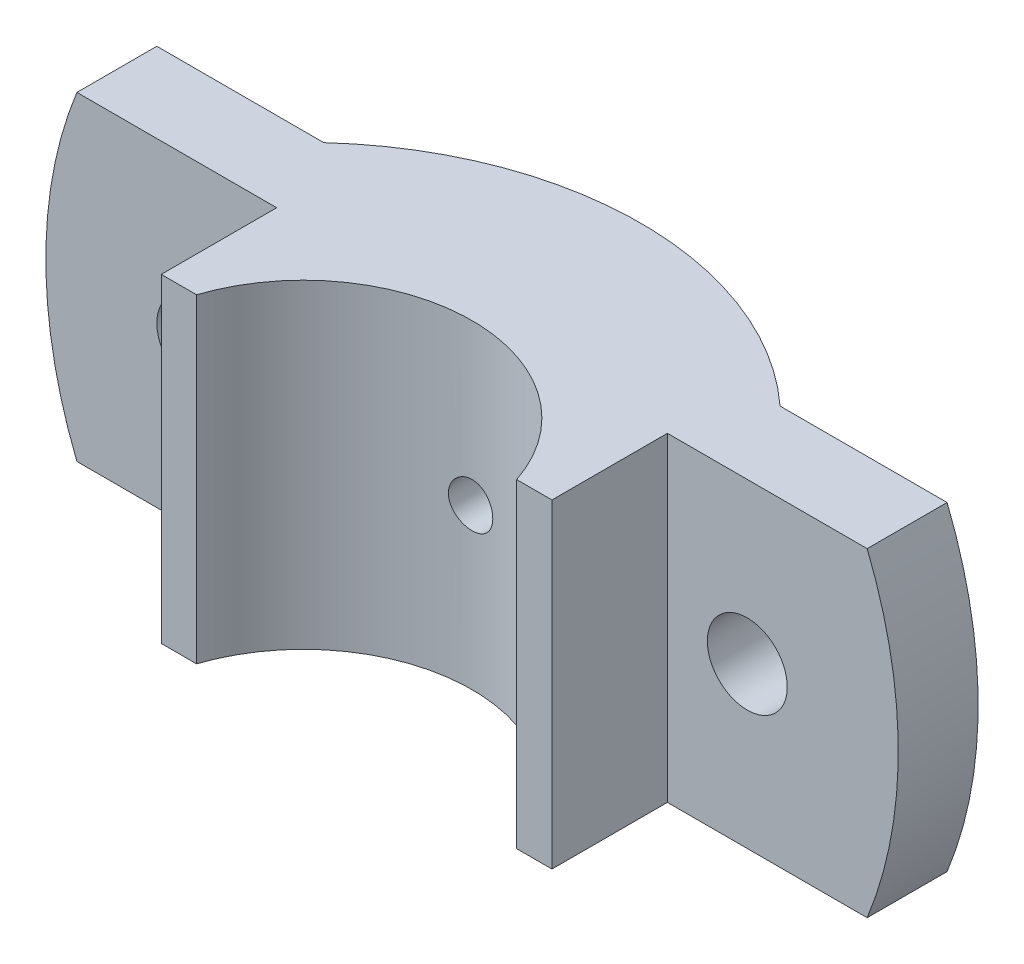
ISO-10303-21;
HEADER;
FILE_DESCRIPTION(('STEP AP214'),'2;1');
FILE_NAME('part.step','',(''),(''),'','','');
FILE_SCHEMA(('AUTOMOTIVE_DESIGN { 1 0 10303 214 1 1 1 1 }'));
ENDSEC;
DATA;
#1=APPLICATION_CONTEXT('core data for automotive mechanical design processes');
#2=APPLICATION_PROTOCOL_DEFINITION('international standard','automotive_design',2000,#1);
#3=PRODUCT_CONTEXT('',#1,'mechanical');
#4=PRODUCT('Part','Part','',(#3));
#5=PRODUCT_RELATED_PRODUCT_CATEGORY('part','',(#4));
#6=PRODUCT_DEFINITION_FORMATION('','',#4);
#7=PRODUCT_DEFINITION_CONTEXT('part definition',#1,'design');
#8=PRODUCT_DEFINITION('design','',#6,#7);
#9=PRODUCT_DEFINITION_SHAPE('','',#8);
#10=(LENGTH_UNIT() NAMED_UNIT(*) SI_UNIT(.MILLI.,.METRE.));
#11=(NAMED_UNIT(*) PLANE_ANGLE_UNIT() SI_UNIT($,.RADIAN.));
#12=(NAMED_UNIT(*) SI_UNIT($,.STERADIAN.) SOLID_ANGLE_UNIT());
#13=UNCERTAINTY_MEASURE_WITH_UNIT(LENGTH_MEASURE(1.E-05),#10,'distance_accuracy_value','');
#14=(GEOMETRIC_REPRESENTATION_CONTEXT(3) GLOBAL_UNCERTAINTY_ASSIGNED_CONTEXT((#13)) GLOBAL_UNIT_ASSIGNED_CONTEXT((#10,
#11,#12)) REPRESENTATION_CONTEXT('',''));
#15=CARTESIAN_POINT('',(0.,0.,0.));
#16=DIRECTION('',(0.,0.,1.));
#17=DIRECTION('',(1.,0.,0.));
#18=AXIS2_PLACEMENT_3D('',#15,#16,#17);
#19=CARTESIAN_POINT('',(22.,18.,-19.));
#20=DIRECTION('',(0.,0.,-1.));
#21=DIRECTION('',(-1.,0.,0.));
#22=AXIS2_PLACEMENT_3D('',#19,#20,#21);
#23=PLANE('',#22);
#24=CARTESIAN_POINT('',(31.,0.,-19.));
#25=DIRECTION('',(0.,0.,-1.));
#26=DIRECTION('',(-1.,0.,0.));
#27=AXIS2_PLACEMENT_3D('',#24,#25,#26);
#28=CIRCLE('',#27,4.49999999999999);
#29=CARTESIAN_POINT('',(26.5,0.,-19.));
#30=VERTEX_POINT('',#29);
#31=EDGE_CURVE('E353',#30,#30,#28,.F.);
#32=ORIENTED_EDGE('',*,*,#31,.F.);
#33=EDGE_LOOP('',(#32));
#34=FACE_BOUND('',#33,.T.);
#35=CARTESIAN_POINT('',(0.,0.,-19.));
#36=DIRECTION('',(0.,0.,-1.));
#37=DIRECTION('',(-1.,0.,0.));
#38=AXIS2_PLACEMENT_3D('',#35,#36,#37);
#39=CIRCLE('',#38,48.);
#40=CARTESIAN_POINT('',(44.497190922574,18.,-19.));
#41=VERTEX_POINT('',#40);
#42=CARTESIAN_POINT('',(44.497190922574,-18.,-19.));
#43=VERTEX_POINT('',#42);
#44=EDGE_CURVE('E50',#41,#43,#39,.T.);
#45=ORIENTED_EDGE('',*,*,#44,.F.);
#46=DIRECTION('',(1.,0.,0.));
#47=VECTOR('',#46,1.);
#48=CARTESIAN_POINT('',(22.,18.,-19.));
#49=LINE('',#48,#47);
#50=CARTESIAN_POINT('',(22.,18.,-19.));
#51=VERTEX_POINT('',#50);
#52=EDGE_CURVE('E147',#51,#41,#49,.T.);
#53=ORIENTED_EDGE('',*,*,#52,.F.);
#54=DIRECTION('',(0.,-1.,0.));
#55=VECTOR('',#54,1.);
#56=CARTESIAN_POINT('',(22.,18.,-19.));
#57=LINE('',#56,#55);
#58=CARTESIAN_POINT('',(22.,-18.,-19.));
#59=VERTEX_POINT('',#58);
#60=EDGE_CURVE('E210',#51,#59,#57,.T.);
#61=ORIENTED_EDGE('',*,*,#60,.T.);
#62=DIRECTION('',(1.,0.,0.));
#63=VECTOR('',#62,1.);
#64=CARTESIAN_POINT('',(22.,-18.,-19.));
#65=LINE('',#64,#63);
#66=EDGE_CURVE('E178',#59,#43,#65,.T.);
#67=ORIENTED_EDGE('',*,*,#66,.T.);
#68=EDGE_LOOP('',(#45,#53,#61,#67));
#69=FACE_BOUND('',#68,.T.);
#70=ADVANCED_FACE('F35',(#34,#69),#23,.F.);
#71=CARTESIAN_POINT('',(50.,18.,-28.));
#72=DIRECTION('',(0.,0.,1.));
#73=DIRECTION('',(1.,0.,0.));
#74=AXIS2_PLACEMENT_3D('',#71,#72,#73);
#75=PLANE('',#74);
#76=CARTESIAN_POINT('',(31.,0.,-28.));
#77=DIRECTION('',(0.,0.,1.));
#78=DIRECTION('',(1.,0.,0.));
#79=AXIS2_PLACEMENT_3D('',#76,#77,#78);
#80=CIRCLE('',#79,4.49999999999999);
#81=CARTESIAN_POINT('',(35.5,0.,-28.));
#82=VERTEX_POINT('',#81);
#83=EDGE_CURVE('E297',#82,#82,#80,.T.);
#84=ORIENTED_EDGE('',*,*,#83,.T.);
#85=EDGE_LOOP('',(#84));
#86=FACE_BOUND('',#85,.T.);
#87=CARTESIAN_POINT('',(0.,0.,-28.));
#88=DIRECTION('',(0.,0.,1.));
#89=DIRECTION('',(1.,0.,0.));
#90=AXIS2_PLACEMENT_3D('',#87,#88,#89);
#91=CIRCLE('',#90,48.);
#92=CARTESIAN_POINT('',(44.497190922574,-18.,-28.));
#93=VERTEX_POINT('',#92);
#94=CARTESIAN_POINT('',(44.497190922574,18.,-28.));
#95=VERTEX_POINT('',#94);
#96=EDGE_CURVE('E135',#93,#95,#91,.T.);
#97=ORIENTED_EDGE('',*,*,#96,.F.);
#98=DIRECTION('',(-1.,0.,0.));
#99=VECTOR('',#98,1.);
#100=CARTESIAN_POINT('',(50.,-18.,-28.));
#101=LINE('',#100,#99);
#102=CARTESIAN_POINT('',(25.6904651573303,-18.,-28.));
#103=VERTEX_POINT('',#102);
#104=EDGE_CURVE('E181',#93,#103,#101,.T.);
#105=ORIENTED_EDGE('',*,*,#104,.T.);
#106=DIRECTION('',(0.,-1.,0.));
#107=VECTOR('',#106,1.);
#108=CARTESIAN_POINT('',(25.6904651573303,18.,-28.));
#109=LINE('',#108,#107);
#110=CARTESIAN_POINT('',(25.6904651573303,-6.63768331230679,-28.));
#111=VERTEX_POINT('',#110);
#112=EDGE_CURVE('E208',#111,#103,#109,.T.);
#113=ORIENTED_EDGE('',*,*,#112,.F.);
#114=CARTESIAN_POINT('',(31.,0.,-28.));
#115=DIRECTION('',(0.,0.,1.));
#116=DIRECTION('',(1.,0.,0.));
#117=AXIS2_PLACEMENT_3D('',#114,#115,#116);
#118=CIRCLE('',#117,8.5);
#119=CARTESIAN_POINT('',(25.6904651573303,6.63768331230679,-28.));
#120=VERTEX_POINT('',#119);
#121=EDGE_CURVE('E58',#120,#111,#118,.T.);
#122=ORIENTED_EDGE('',*,*,#121,.F.);
#123=CARTESIAN_POINT('',(25.6904651573303,18.,-28.));
#124=VERTEX_POINT('',#123);
#125=EDGE_CURVE('E151',#124,#120,#109,.T.);
#126=ORIENTED_EDGE('',*,*,#125,.F.);
#127=DIRECTION('',(-1.,0.,0.));
#128=VECTOR('',#127,1.);
#129=CARTESIAN_POINT('',(50.,18.,-28.));
#130=LINE('',#129,#128);
#131=EDGE_CURVE('E145',#95,#124,#130,.T.);
#132=ORIENTED_EDGE('',*,*,#131,.F.);
#133=EDGE_LOOP('',(#97,#105,#113,#122,#126,#132));
#134=FACE_BOUND('',#133,.T.);
#135=ADVANCED_FACE('F149',(#86,#134),#75,.F.);
#136=CARTESIAN_POINT('',(0.,18.,0.));
#137=DIRECTION('',(0.,1.,0.));
#138=DIRECTION('',(0.,0.,1.));
#139=AXIS2_PLACEMENT_3D('',#136,#137,#138);
#140=PLANE('',#139);
#141=ORIENTED_EDGE('',*,*,#52,.T.);
#142=DIRECTION('',(0.,0.,1.));
#143=VECTOR('',#142,1.);
#144=CARTESIAN_POINT('',(44.497190922574,18.,-38.));
#145=LINE('',#144,#143);
#146=EDGE_CURVE('E138',#95,#41,#145,.T.);
#147=ORIENTED_EDGE('',*,*,#146,.F.);
#148=ORIENTED_EDGE('',*,*,#131,.T.);
#149=CARTESIAN_POINT('',(0.,18.,0.));
#150=DIRECTION('',(0.,1.,0.));
#151=DIRECTION('',(0.,0.,1.));
#152=AXIS2_PLACEMENT_3D('',#149,#150,#151);
#153=CIRCLE('',#152,38.);
#154=CARTESIAN_POINT('',(-25.6904651573303,18.,-28.));
#155=VERTEX_POINT('',#154);
#156=EDGE_CURVE('E153',#124,#155,#153,.T.);
#157=ORIENTED_EDGE('',*,*,#156,.T.);
#158=DIRECTION('',(-1.,0.,0.));
#159=VECTOR('',#158,1.);
#160=CARTESIAN_POINT('',(-50.,18.,-28.));
#161=LINE('',#160,#159);
#162=CARTESIAN_POINT('',(-44.497190922574,18.,-28.));
#163=VERTEX_POINT('',#162);
#164=EDGE_CURVE('E155',#155,#163,#161,.T.);
#165=ORIENTED_EDGE('',*,*,#164,.T.);
#166=DIRECTION('',(0.,0.,1.));
#167=VECTOR('',#166,1.);
#168=CARTESIAN_POINT('',(-44.497190922574,18.,-38.));
#169=LINE('',#168,#167);
#170=CARTESIAN_POINT('',(-44.497190922574,18.,-19.));
#171=VERTEX_POINT('',#170);
#172=EDGE_CURVE('E338',#163,#171,#169,.T.);
#173=ORIENTED_EDGE('',*,*,#172,.T.);
#174=DIRECTION('',(1.,0.,0.));
#175=VECTOR('',#174,1.);
#176=CARTESIAN_POINT('',(-22.,18.,-19.));
#177=LINE('',#176,#175);
#178=CARTESIAN_POINT('',(-22.,18.,-19.));
#179=VERTEX_POINT('',#178);
#180=EDGE_CURVE('E163',#171,#179,#177,.T.);
#181=ORIENTED_EDGE('',*,*,#180,.T.);
#182=DIRECTION('',(0.,0.,1.));
#183=VECTOR('',#182,1.);
#184=CARTESIAN_POINT('',(-22.,18.,-6.));
#185=LINE('',#184,#183);
#186=CARTESIAN_POINT('',(-22.,18.,-6.));
#187=VERTEX_POINT('',#186);
#188=EDGE_CURVE('E165',#179,#187,#185,.T.);
#189=ORIENTED_EDGE('',*,*,#188,.T.);
#190=DIRECTION('',(1.,0.,0.));
#191=VECTOR('',#190,1.);
#192=CARTESIAN_POINT('',(-18.0277563773199,18.,-6.));
#193=LINE('',#192,#191);
#194=CARTESIAN_POINT('',(-18.0277563773199,18.,-6.));
#195=VERTEX_POINT('',#194);
#196=EDGE_CURVE('E167',#187,#195,#193,.T.);
#197=ORIENTED_EDGE('',*,*,#196,.T.);
#198=CARTESIAN_POINT('',(0.,18.,0.));
#199=DIRECTION('',(0.,-1.,0.));
#200=DIRECTION('',(0.,0.,1.));
#201=AXIS2_PLACEMENT_3D('',#198,#199,#200);
#202=CIRCLE('',#201,19.);
#203=CARTESIAN_POINT('',(18.0277563773199,18.,-6.));
#204=VERTEX_POINT('',#203);
#205=EDGE_CURVE('E195',#195,#204,#202,.T.);
#206=ORIENTED_EDGE('',*,*,#205,.T.);
#207=DIRECTION('',(1.,0.,0.));
#208=VECTOR('',#207,1.);
#209=CARTESIAN_POINT('',(18.0277563773199,18.,-6.));
#210=LINE('',#209,#208);
#211=CARTESIAN_POINT('',(22.,18.,-6.));
#212=VERTEX_POINT('',#211);
#213=EDGE_CURVE('E279',#204,#212,#210,.T.);
#214=ORIENTED_EDGE('',*,*,#213,.T.);
#215=DIRECTION('',(0.,0.,-1.));
#216=VECTOR('',#215,1.);
#217=CARTESIAN_POINT('',(22.,18.,-6.));
#218=LINE('',#217,#216);
#219=EDGE_CURVE('E157',#212,#51,#218,.T.);
#220=ORIENTED_EDGE('',*,*,#219,.T.);
#221=EDGE_LOOP('',(#141,#147,#148,#157,#165,#173,#181,#189,#197,#206,#214,#220));
#222=FACE_BOUND('',#221,.T.);
#223=ADVANCED_FACE('F144',(#222),#140,.T.);
#224=CARTESIAN_POINT('',(0.,-18.,0.));
#225=DIRECTION('',(0.,1.,0.));
#226=DIRECTION('',(0.,0.,1.));
#227=AXIS2_PLACEMENT_3D('',#224,#225,#226);
#228=PLANE('',#227);
#229=DIRECTION('',(0.,0.,1.));
#230=VECTOR('',#229,1.);
#231=CARTESIAN_POINT('',(44.497190922574,-18.,-38.));
#232=LINE('',#231,#230);
#233=EDGE_CURVE('E11',#43,#93,#232,.F.);
#234=ORIENTED_EDGE('',*,*,#233,.F.);
#235=ORIENTED_EDGE('',*,*,#66,.F.);
#236=DIRECTION('',(0.,0.,-1.));
#237=VECTOR('',#236,1.);
#238=CARTESIAN_POINT('',(22.,-18.,-6.));
#239=LINE('',#238,#237);
#240=CARTESIAN_POINT('',(22.,-18.,-6.));
#241=VERTEX_POINT('',#240);
#242=EDGE_CURVE('E176',#241,#59,#239,.T.);
#243=ORIENTED_EDGE('',*,*,#242,.F.);
#244=DIRECTION('',(1.,0.,0.));
#245=VECTOR('',#244,1.);
#246=CARTESIAN_POINT('',(18.0277563773199,-18.,-6.));
#247=LINE('',#246,#245);
#248=CARTESIAN_POINT('',(18.0277563773199,-18.,-6.));
#249=VERTEX_POINT('',#248);
#250=EDGE_CURVE('E173',#249,#241,#247,.T.);
#251=ORIENTED_EDGE('',*,*,#250,.F.);
#252=CARTESIAN_POINT('',(0.,-18.,0.));
#253=DIRECTION('',(0.,-1.,0.));
#254=DIRECTION('',(0.,0.,1.));
#255=AXIS2_PLACEMENT_3D('',#252,#253,#254);
#256=CIRCLE('',#255,19.);
#257=CARTESIAN_POINT('',(-18.0277563773199,-18.,-6.));
#258=VERTEX_POINT('',#257);
#259=EDGE_CURVE('E170',#258,#249,#256,.T.);
#260=ORIENTED_EDGE('',*,*,#259,.F.);
#261=DIRECTION('',(1.,0.,0.));
#262=VECTOR('',#261,1.);
#263=CARTESIAN_POINT('',(-18.0277563773199,-18.,-6.));
#264=LINE('',#263,#262);
#265=CARTESIAN_POINT('',(-22.,-18.,-6.));
#266=VERTEX_POINT('',#265);
#267=EDGE_CURVE('E193',#266,#258,#264,.T.);
#268=ORIENTED_EDGE('',*,*,#267,.F.);
#269=DIRECTION('',(0.,0.,1.));
#270=VECTOR('',#269,1.);
#271=CARTESIAN_POINT('',(-22.,-18.,-6.));
#272=LINE('',#271,#270);
#273=CARTESIAN_POINT('',(-22.,-18.,-19.));
#274=VERTEX_POINT('',#273);
#275=EDGE_CURVE('E191',#274,#266,#272,.T.);
#276=ORIENTED_EDGE('',*,*,#275,.F.);
#277=DIRECTION('',(1.,0.,0.));
#278=VECTOR('',#277,1.);
#279=CARTESIAN_POINT('',(-22.,-18.,-19.));
#280=LINE('',#279,#278);
#281=CARTESIAN_POINT('',(-44.497190922574,-18.,-19.));
#282=VERTEX_POINT('',#281);
#283=EDGE_CURVE('E189',#282,#274,#280,.T.);
#284=ORIENTED_EDGE('',*,*,#283,.F.);
#285=DIRECTION('',(0.,0.,1.));
#286=VECTOR('',#285,1.);
#287=CARTESIAN_POINT('',(-44.497190922574,-18.,-38.));
#288=LINE('',#287,#286);
#289=CARTESIAN_POINT('',(-44.497190922574,-18.,-28.));
#290=VERTEX_POINT('',#289);
#291=EDGE_CURVE('E219',#282,#290,#288,.F.);
#292=ORIENTED_EDGE('',*,*,#291,.T.);
#293=DIRECTION('',(-1.,0.,0.));
#294=VECTOR('',#293,1.);
#295=CARTESIAN_POINT('',(-50.,-18.,-28.));
#296=LINE('',#295,#294);
#297=CARTESIAN_POINT('',(-25.6904651573303,-18.,-28.));
#298=VERTEX_POINT('',#297);
#299=EDGE_CURVE('E186',#298,#290,#296,.T.);
#300=ORIENTED_EDGE('',*,*,#299,.F.);
#301=CARTESIAN_POINT('',(0.,-18.,0.));
#302=DIRECTION('',(0.,1.,0.));
#303=DIRECTION('',(0.,0.,1.));
#304=AXIS2_PLACEMENT_3D('',#301,#302,#303);
#305=CIRCLE('',#304,38.);
#306=EDGE_CURVE('E183',#103,#298,#305,.T.);
#307=ORIENTED_EDGE('',*,*,#306,.F.);
#308=ORIENTED_EDGE('',*,*,#104,.F.);
#309=EDGE_LOOP('',(#234,#235,#243,#251,#260,#268,#276,#284,#292,#300,#307,#308));
#310=FACE_BOUND('',#309,.T.);
#311=ADVANCED_FACE('F328',(#310),#228,.F.);
#312=CARTESIAN_POINT('',(0.,18.,0.));
#313=DIRECTION('',(0.,-1.,0.));
#314=DIRECTION('',(0.,0.,-1.));
#315=AXIS2_PLACEMENT_3D('',#312,#313,#314);
#316=CYLINDRICAL_SURFACE('',#315,38.);
#317=CARTESIAN_POINT('',(-3.,0.,-37.8813938497516));
#318=CARTESIAN_POINT('',(-2.99999263785232,-0.168229356223722,-37.881395424836));
#319=CARTESIAN_POINT('',(-2.98580184849922,-0.336574006245494,-37.8825265582867));
#320=CARTESIAN_POINT('',(-2.92939974932902,-0.668607649957893,-37.8869289647691));
#321=CARTESIAN_POINT('',(-2.88715648723707,-0.832291112499562,-37.8902026781767));
#322=CARTESIAN_POINT('',(-2.77587681608236,-1.15014522375751,-37.8985171541647));
#323=CARTESIAN_POINT('',(-2.70685535144458,-1.30432112294825,-37.9035569309858));
#324=CARTESIAN_POINT('',(-2.54400458445208,-1.59886160168987,-37.9148344391245));
#325=CARTESIAN_POINT('',(-2.45018067379415,-1.73922917388467,-37.92107191));
#326=CARTESIAN_POINT('',(-2.24015280345188,-2.00253137226757,-37.9340582512773));
#327=CARTESIAN_POINT('',(-2.12390328154721,-2.12542960763649,-37.9408081455451));
#328=CARTESIAN_POINT('',(-1.87242010716811,-2.34999209013841,-37.9540493837728));
#329=CARTESIAN_POINT('',(-1.7371856346283,-2.45165541954578,-37.9605407165486));
#330=CARTESIAN_POINT('',(-1.45135636719248,-2.63098168610704,-37.9725429812434));
#331=CARTESIAN_POINT('',(-1.3007419119018,-2.708613379424,-37.9780526329515));
#332=CARTESIAN_POINT('',(-0.988565369760012,-2.83747282349098,-37.9874597537665));
#333=CARTESIAN_POINT('',(-0.827003457103221,-2.88870099425837,-37.9913572485189));
#334=CARTESIAN_POINT('',(-0.497878390626905,-2.96319512715382,-37.9970937704964));
#335=CARTESIAN_POINT('',(-0.330328567016738,-2.98651964678538,-37.998937107936));
#336=CARTESIAN_POINT('',(0.00631733654750819,-3.00472535926791,-38.0003722094706));
#337=CARTESIAN_POINT('',(0.17541339034767,-2.99960703233397,-37.9999640115795));
#338=CARTESIAN_POINT('',(0.509954787192965,-2.96112032248106,-37.9969456003133));
#339=CARTESIAN_POINT('',(0.675407425277911,-2.92781491240174,-37.9943402955467));
#340=CARTESIAN_POINT('',(0.998366668593193,-2.83399732705022,-37.9872264182713));
#341=CARTESIAN_POINT('',(1.1558732048081,-2.77348491551835,-37.9827178292348));
#342=CARTESIAN_POINT('',(1.45867002090717,-2.62690060373558,-37.9722962502068));
#343=CARTESIAN_POINT('',(1.6039465541759,-2.54080042217035,-37.9663817077167));
#344=CARTESIAN_POINT('',(1.87800944429183,-2.34550517866702,-37.9538131184224));
#345=CARTESIAN_POINT('',(2.00679550141833,-2.23630969705862,-37.9471590581814));
#346=CARTESIAN_POINT('',(2.24458971981857,-1.99756841972296,-37.9338380622355));
#347=CARTESIAN_POINT('',(2.35354296660022,-1.86796791907116,-37.9271711409281));
#348=CARTESIAN_POINT('',(2.54815472752468,-1.59228636571936,-37.9145941321889));
#349=CARTESIAN_POINT('',(2.63381322519709,-1.44620530136698,-37.9086840452923));
#350=CARTESIAN_POINT('',(2.77940144234371,-1.14167162060739,-37.8982886351211));
#351=CARTESIAN_POINT('',(2.83932843779762,-0.983217696466581,-37.8938034627057));
#352=CARTESIAN_POINT('',(2.93171253141031,-0.658454052626348,-37.8867684945926));
#353=CARTESIAN_POINT('',(2.96417014717686,-0.492144481013883,-37.8842186624274));
#354=CARTESIAN_POINT('',(3.00062486955395,-0.156870629588011,-37.8813488492975));
#355=CARTESIAN_POINT('',(3.00469849779479,0.0120852808075237,-37.8810228729924));
#356=CARTESIAN_POINT('',(2.98446993701008,0.348277674479456,-37.8826218486592));
#357=CARTESIAN_POINT('',(2.96016798514648,0.515514172114851,-37.884546781818));
#358=CARTESIAN_POINT('',(2.88394184726828,0.843301603254928,-37.8904252096708));
#359=CARTESIAN_POINT('',(2.83205326228916,1.00386086655318,-37.8943760896121));
#360=CARTESIAN_POINT('',(2.70216294400362,1.31399395677734,-37.9038590548662));
#361=CARTESIAN_POINT('',(2.62416083401247,1.46356762519929,-37.9093911629878));
#362=CARTESIAN_POINT('',(2.44406357833825,1.74783416137562,-37.9214277776749));
#363=CARTESIAN_POINT('',(2.34191737427747,1.88249459296493,-37.9279343341079));
#364=CARTESIAN_POINT('',(2.11650535947004,2.13278456634997,-37.9411797159946));
#365=CARTESIAN_POINT('',(1.99323922217928,2.2484138138424,-37.9479185450382));
#366=CARTESIAN_POINT('',(1.72875604909499,2.45761968980163,-37.9608869464052));
#367=CARTESIAN_POINT('',(1.58749965829182,2.55114664697588,-37.9671153515116));
#368=CARTESIAN_POINT('',(1.29124223392212,2.71315246287969,-37.9783443227055));
#369=CARTESIAN_POINT('',(1.13624132557013,2.78163154976985,-37.9833448999771));
#370=CARTESIAN_POINT('',(0.817073838218854,2.8915121915042,-37.9915493740706));
#371=CARTESIAN_POINT('',(0.652917946506943,2.93294463032733,-37.9947553195452));
#372=CARTESIAN_POINT('',(0.31995323250893,2.98765683143964,-37.999017594232));
#373=CARTESIAN_POINT('',(0.151144488421416,3.00093706657949,-38.0000739595491));
#374=CARTESIAN_POINT('',(-0.185844007724724,2.99896261174756,-37.9999181203354));
#375=CARTESIAN_POINT('',(-0.35402422206125,2.98378540562109,-37.9987120758837));
#376=CARTESIAN_POINT('',(-0.685439460070172,2.92548825985853,-37.9941791393791));
#377=CARTESIAN_POINT('',(-0.848674476485684,2.88236827921959,-37.9908522442141));
#378=CARTESIAN_POINT('',(-1.16557212517757,2.76942883565186,-37.9824510315142));
#379=CARTESIAN_POINT('',(-1.3192351758783,2.69961054075429,-37.9773767904253));
#380=CARTESIAN_POINT('',(-1.61267080850138,2.53526551305573,-37.9660490429656));
#381=CARTESIAN_POINT('',(-1.7524436427022,2.44073922912224,-37.9597955580186));
#382=CARTESIAN_POINT('',(-2.01452730784427,2.22937105364119,-37.9467913112364));
#383=CARTESIAN_POINT('',(-2.13679197870458,2.1124720037035,-37.9400393035084));
#384=CARTESIAN_POINT('',(-2.3600119308789,1.85977604977668,-37.926809547746));
#385=CARTESIAN_POINT('',(-2.46096203215627,1.72397456524185,-37.9203318666858));
#386=CARTESIAN_POINT('',(-2.63880908526894,1.43709086811672,-37.9083720300883));
#387=CARTESIAN_POINT('',(-2.71566430398237,1.28598273615028,-37.9028916086487));
#388=CARTESIAN_POINT('',(-2.84281465262269,0.973068347368231,-37.8935681492736));
#389=CARTESIAN_POINT('',(-2.89314045280837,0.811274688620424,-37.8897232215665));
#390=CARTESIAN_POINT('',(-2.95292421077471,0.540431663186952,-37.8850993601198));
#391=CARTESIAN_POINT('',(-2.97055431578336,0.433126408915519,-37.883716139462));
#392=CARTESIAN_POINT('',(-2.99409457369405,0.217230128113448,-37.8818628767795));
#393=CARTESIAN_POINT('',(-3.00000475432558,0.108639104625571,-37.8813928325941));
#394=CARTESIAN_POINT('',(-3.,0.,-37.8813938497516));
#395=B_SPLINE_CURVE_WITH_KNOTS('',3,(#317,#318,#319,#320,#321,#322,#323,#324,#325,#326,#327,
#328,#329,#330,#331,#332,#333,#334,#335,#336,#337,#338,#339,#340,#341,#342,#343,#344,#345,#346,
#347,#348,#349,#350,#351,#352,#353,#354,#355,#356,#357,#358,#359,#360,#361,#362,#363,#364,#365,
#366,#367,#368,#369,#370,#371,#372,#373,#374,#375,#376,#377,#378,#379,#380,#381,#382,#383,#384,
#385,#386,#387,#388,#389,#390,#391,#392,#393,#394),.UNSPECIFIED.,.T.,.F.,(4,2,2,2,2,2,2,2,2,2,2,
2,2,2,2,2,2,2,2,2,2,2,2,2,2,2,2,2,2,2,2,2,2,2,2,2,2,2,4),(0.,0.50429142166999,1.00915822788302,
1.51374368152857,2.01821953559138,2.52373134073238,3.02926498845646,3.53545315301367,
4.04163326507022,4.54674925358301,5.05185671399058,5.55583868228783,6.05982502713928,
6.56437049631087,7.0689251344883,7.57485624621251,8.08078771565083,8.58677273143867,
9.0927482126973,9.59735908295555,10.1019657357268,10.6059227598395,11.10988705379,
11.6149267875576,12.1199743306602,12.6261463157289,13.1323136899712,13.6379020669613,
14.1434819519093,14.6476872439429,15.1518932758423,15.6560772516295,16.1602520685946,
16.6657325841807,17.1713358046313,17.6778099691558,18.1836973153048,18.5093592531184,
18.8350204204103),.UNSPECIFIED.);
#396=CARTESIAN_POINT('',(-3.,0.,-37.8813938497516));
#397=VERTEX_POINT('',#396);
#398=EDGE_CURVE('E44',#397,#397,#395,.T.);
#399=ORIENTED_EDGE('',*,*,#398,.T.);
#400=EDGE_LOOP('',(#399));
#401=FACE_BOUND('',#400,.T.);
#402=ORIENTED_EDGE('',*,*,#125,.T.);
#403=CARTESIAN_POINT('',(25.6904651573303,6.63768331230679,-28.));
#404=CARTESIAN_POINT('',(25.5360851043424,6.51420867249736,-28.1416681018721));
#405=CARTESIAN_POINT('',(25.3836215551735,6.38340380017068,-28.2791823336498));
#406=CARTESIAN_POINT('',(25.0841053598261,6.1068595072457,-28.5451833866574));
#407=CARTESIAN_POINT('',(24.9370580895264,5.96110576476093,-28.6736613482156));
#408=CARTESIAN_POINT('',(24.6491941230388,5.65349144226199,-28.9215085426633));
#409=CARTESIAN_POINT('',(24.508431723833,5.49151942353939,-29.0408031542341));
#410=CARTESIAN_POINT('',(24.2363075607749,5.15263687836669,-29.2682904084011));
#411=CARTESIAN_POINT('',(24.1049430857226,4.97573069263071,-29.3764862568107));
#412=CARTESIAN_POINT('',(23.8528205053459,4.60631493821572,-29.5815743674557));
#413=CARTESIAN_POINT('',(23.7321338833277,4.41371469093334,-29.6783916917415));
#414=CARTESIAN_POINT('',(23.5043908446779,4.01479632179464,-29.85908164754));
#415=CARTESIAN_POINT('',(23.3973358972541,3.80847672492269,-29.942952883943));
#416=CARTESIAN_POINT('',(23.1992536300817,3.38422419101504,-30.0966827286364));
#417=CARTESIAN_POINT('',(23.1081729651954,3.1663331999127,-30.1665880882949));
#418=CARTESIAN_POINT('',(22.9434688496595,2.72008092153074,-30.2920447623401));
#419=CARTESIAN_POINT('',(22.869842066784,2.49172164276593,-30.347598816803));
#420=CARTESIAN_POINT('',(22.7499342032063,2.05682098381956,-30.4375648556656));
#421=CARTESIAN_POINT('',(22.7013462567531,1.85128534823191,-30.4737833576563));
#422=CARTESIAN_POINT('',(22.6194172898017,1.43551725204115,-30.534645499234));
#423=CARTESIAN_POINT('',(22.5860747992536,1.2252852463389,-30.5592902548309));
#424=CARTESIAN_POINT('',(22.5352129551669,0.801799591498527,-30.5968164834569));
#425=CARTESIAN_POINT('',(22.5176992505084,0.588544891193922,-30.6096937569973));
#426=CARTESIAN_POINT('',(22.4988301660851,0.160939560666235,-30.6235658271181));
#427=CARTESIAN_POINT('',(22.4974739036633,-0.0534110090511325,-30.624561272785));
#428=CARTESIAN_POINT('',(22.5103301119086,-0.461997479818149,-30.6151119876343));
#429=CARTESIAN_POINT('',(22.5231488228924,-0.656303160135775,-30.6056914251709));
#430=CARTESIAN_POINT('',(22.5619809221014,-1.04286259298841,-30.5770763766543));
#431=CARTESIAN_POINT('',(22.5879939672906,-1.23511639873688,-30.5578821447042));
#432=CARTESIAN_POINT('',(22.6528192304938,-1.61613906729809,-30.5098574663833));
#433=CARTESIAN_POINT('',(22.6916259266854,-1.80490939654948,-30.4810311771979));
#434=CARTESIAN_POINT('',(22.7814851533843,-2.17779604427594,-30.4139289484325));
#435=CARTESIAN_POINT('',(22.8325379785097,-2.36191225066403,-30.3756527815061));
#436=CARTESIAN_POINT('',(22.9463727274414,-2.72495933677603,-30.2897519777021));
#437=CARTESIAN_POINT('',(23.0091940590921,-2.90387039063447,-30.2420959034169));
#438=CARTESIAN_POINT('',(23.1456283742011,-3.2548914886335,-30.1378044455698));
#439=CARTESIAN_POINT('',(23.2192449894415,-3.4269992191435,-30.0811660396201));
#440=CARTESIAN_POINT('',(23.3763137314078,-3.76349373210636,-29.9592695660632));
#441=CARTESIAN_POINT('',(23.4597660818508,-3.92788033882065,-29.8940113023904));
#442=CARTESIAN_POINT('',(23.635527045378,-4.24828704232642,-29.7552415450916));
#443=CARTESIAN_POINT('',(23.7278387953854,-4.40430414494655,-29.6817271265587));
#444=CARTESIAN_POINT('',(23.9282386479047,-4.71995510834891,-29.5204551498758));
#445=CARTESIAN_POINT('',(24.0370002176616,-4.87881602386905,-29.432022004933));
#446=CARTESIAN_POINT('',(24.2623844714665,-5.1856332961988,-29.2465042091278));
#447=CARTESIAN_POINT('',(24.379010630913,-5.33358477081361,-29.149415727248));
#448=CARTESIAN_POINT('',(24.6187042069683,-5.61815393006346,-28.9472618083659));
#449=CARTESIAN_POINT('',(24.7417672458198,-5.75477915839727,-28.8422017715012));
#450=CARTESIAN_POINT('',(24.9931857635632,-6.016738259449,-28.6246099475779));
#451=CARTESIAN_POINT('',(25.121541230047,-6.14207215863704,-28.5120781780363));
#452=CARTESIAN_POINT('',(25.3239635142993,-6.32788833390874,-28.3320696328102));
#453=CARTESIAN_POINT('',(25.3966039536003,-6.39227987552885,-28.2669811541268));
#454=CARTESIAN_POINT('',(25.5428336292653,-6.5175597465675,-28.1349133065772));
#455=CARTESIAN_POINT('',(25.6164208573994,-6.57845434819235,-28.0679376662269));
#456=CARTESIAN_POINT('',(25.6904651573302,-6.63768331230706,-28.0000000000002));
#457=B_SPLINE_CURVE_WITH_KNOTS('',3,(#403,#404,#405,#406,#407,#408,#409,#410,#411,#412,#413,
#414,#415,#416,#417,#418,#419,#420,#421,#422,#423,#424,#425,#426,#427,#428,#429,#430,#431,#432,
#433,#434,#435,#436,#437,#438,#439,#440,#441,#442,#443,#444,#445,#446,#447,#448,#449,#450,#451,
#452,#453,#454,#455,#456),.UNSPECIFIED.,.F.,.F.,(4,2,2,2,2,2,2,2,2,2,2,2,2,2,2,2,2,2,2,2,2,2,2,
2,2,2,4),(0.,0.729592400834071,1.45989044138351,2.19560470883998,2.93110586753775,
3.67120763552798,4.41138910352643,5.14904966030397,5.8865692722368,6.52855006409984,
7.17046893961489,7.8126168088522,8.45472959834445,9.03890309081732,9.62306139629814,
10.2069679046447,10.7908884620571,11.3768004587137,11.9629100238154,12.549032922753,
13.1353641263273,13.7703169673958,14.4055522594533,15.040361004022,15.6751682603777,
16.0257258218313,16.3756336015193),.UNSPECIFIED.);
#458=EDGE_CURVE('E289',#120,#111,#457,.T.);
#459=ORIENTED_EDGE('',*,*,#458,.T.);
#460=ORIENTED_EDGE('',*,*,#112,.T.);
#461=ORIENTED_EDGE('',*,*,#306,.T.);
#462=DIRECTION('',(0.,-1.,0.));
#463=VECTOR('',#462,1.);
#464=CARTESIAN_POINT('',(-25.6904651573303,18.,-28.));
#465=LINE('',#464,#463);
#466=CARTESIAN_POINT('',(-25.6904651573303,-6.63768331230679,-28.));
#467=VERTEX_POINT('',#466);
#468=EDGE_CURVE('E204',#467,#298,#465,.T.);
#469=ORIENTED_EDGE('',*,*,#468,.F.);
#470=CARTESIAN_POINT('',(-25.6904651573303,6.6376833123068,-28.));
#471=CARTESIAN_POINT('',(-25.5360851043424,6.51420867249737,-28.1416681018721));
#472=CARTESIAN_POINT('',(-25.3836215551735,6.38340380017068,-28.2791823336498));
#473=CARTESIAN_POINT('',(-25.0841053598261,6.1068595072457,-28.5451833866574));
#474=CARTESIAN_POINT('',(-24.9370580895264,5.96110576476093,-28.6736613482156));
#475=CARTESIAN_POINT('',(-24.6491941230388,5.653491442262,-28.9215085426632));
#476=CARTESIAN_POINT('',(-24.508431723833,5.4915194235394,-29.0408031542341));
#477=CARTESIAN_POINT('',(-24.2363075607749,5.15263687836669,-29.2682904084011));
#478=CARTESIAN_POINT('',(-24.1049430857226,4.97573069263071,-29.3764862568107));
#479=CARTESIAN_POINT('',(-23.8528205053459,4.60631493821572,-29.5815743674557));
#480=CARTESIAN_POINT('',(-23.7321338833277,4.41371469093334,-29.6783916917415));
#481=CARTESIAN_POINT('',(-23.5043908446779,4.01479632179465,-29.85908164754));
#482=CARTESIAN_POINT('',(-23.3973358972541,3.8084767249227,-29.942952883943));
#483=CARTESIAN_POINT('',(-23.1992536300817,3.38422419101504,-30.0966827286364));
#484=CARTESIAN_POINT('',(-23.1081729651954,3.1663331999127,-30.1665880882949));
#485=CARTESIAN_POINT('',(-22.9434688496595,2.72008092153075,-30.2920447623401));
#486=CARTESIAN_POINT('',(-22.869842066784,2.49172164276593,-30.347598816803));
#487=CARTESIAN_POINT('',(-22.7499342032063,2.05682098381956,-30.4375648556656));
#488=CARTESIAN_POINT('',(-22.7013462567531,1.85128534823191,-30.4737833576563));
#489=CARTESIAN_POINT('',(-22.6194172898017,1.43551725204115,-30.534645499234));
#490=CARTESIAN_POINT('',(-22.5860747992536,1.22528524633891,-30.5592902548309));
#491=CARTESIAN_POINT('',(-22.5352129551669,0.80179959149853,-30.5968164834569));
#492=CARTESIAN_POINT('',(-22.5176992505084,0.588544891193924,-30.6096937569973));
#493=CARTESIAN_POINT('',(-22.4988301660851,0.160939560666237,-30.6235658271181));
#494=CARTESIAN_POINT('',(-22.4974739036633,-0.0534110090511305,-30.624561272785));
#495=CARTESIAN_POINT('',(-22.5103301119086,-0.461997479818147,-30.6151119876343));
#496=CARTESIAN_POINT('',(-22.5231488228924,-0.656303160135774,-30.6056914251709));
#497=CARTESIAN_POINT('',(-22.5619809221014,-1.04286259298841,-30.5770763766543));
#498=CARTESIAN_POINT('',(-22.5879939672906,-1.23511639873688,-30.5578821447042));
#499=CARTESIAN_POINT('',(-22.6528192304938,-1.61613906729809,-30.5098574663833));
#500=CARTESIAN_POINT('',(-22.6916259266854,-1.80490939654948,-30.4810311771979));
#501=CARTESIAN_POINT('',(-22.7814851533843,-2.17779604427594,-30.4139289484325));
#502=CARTESIAN_POINT('',(-22.8325379785097,-2.36191225066402,-30.3756527815061));
#503=CARTESIAN_POINT('',(-22.9463727274414,-2.72495933677602,-30.2897519777021));
#504=CARTESIAN_POINT('',(-23.0091940590921,-2.90387039063447,-30.2420959034169));
#505=CARTESIAN_POINT('',(-23.1456283742011,-3.2548914886335,-30.1378044455698));
#506=CARTESIAN_POINT('',(-23.2192449894415,-3.42699921914349,-30.0811660396201));
#507=CARTESIAN_POINT('',(-23.3763137314078,-3.76349373210636,-29.9592695660632));
#508=CARTESIAN_POINT('',(-23.4597660818508,-3.92788033882065,-29.8940113023904));
#509=CARTESIAN_POINT('',(-23.635527045378,-4.24828704232642,-29.7552415450916));
#510=CARTESIAN_POINT('',(-23.7278387953854,-4.40430414494655,-29.6817271265587));
#511=CARTESIAN_POINT('',(-23.9282386479047,-4.71995510834891,-29.5204551498758));
#512=CARTESIAN_POINT('',(-24.0370002176616,-4.87881602386905,-29.432022004933));
#513=CARTESIAN_POINT('',(-24.2623844714665,-5.1856332961988,-29.2465042091278));
#514=CARTESIAN_POINT('',(-24.379010630913,-5.33358477081361,-29.1494157272481));
#515=CARTESIAN_POINT('',(-24.6187042069683,-5.61815393006346,-28.9472618083659));
#516=CARTESIAN_POINT('',(-24.7417672458198,-5.75477915839727,-28.8422017715012));
#517=CARTESIAN_POINT('',(-24.9931857635632,-6.016738259449,-28.6246099475779));
#518=CARTESIAN_POINT('',(-25.121541230047,-6.14207215863704,-28.5120781780363));
#519=CARTESIAN_POINT('',(-25.3239635142993,-6.32788833390874,-28.3320696328102));
#520=CARTESIAN_POINT('',(-25.3966039536003,-6.39227987552885,-28.2669811541268));
#521=CARTESIAN_POINT('',(-25.5428336292653,-6.51755974656749,-28.1349133065772));
#522=CARTESIAN_POINT('',(-25.6164208573994,-6.57845434819235,-28.0679376662269));
#523=CARTESIAN_POINT('',(-25.6904651573302,-6.63768331230705,-28.0000000000002));
#524=B_SPLINE_CURVE_WITH_KNOTS('',3,(#470,#471,#472,#473,#474,#475,#476,#477,#478,#479,#480,
#481,#482,#483,#484,#485,#486,#487,#488,#489,#490,#491,#492,#493,#494,#495,#496,#497,#498,#499,
#500,#501,#502,#503,#504,#505,#506,#507,#508,#509,#510,#511,#512,#513,#514,#515,#516,#517,#518,
#519,#520,#521,#522,#523),.UNSPECIFIED.,.F.,.F.,(4,2,2,2,2,2,2,2,2,2,2,2,2,2,2,2,2,2,2,2,2,2,2,
2,2,2,4),(0.,0.729592400834072,1.45989044138351,2.19560470883999,2.93110586753776,
3.67120763552798,4.41138910352643,5.14904966030397,5.8865692722368,6.52855006409985,
7.1704689396149,7.81261680885221,8.45472959834446,9.03890309081733,9.62306139629815,
10.2069679046447,10.7908884620571,11.3768004587137,11.9629100238154,12.549032922753,
13.1353641263273,13.7703169673958,14.4055522594533,15.040361004022,15.6751682603777,
16.0257258218313,16.3756336015193),.UNSPECIFIED.);
#525=CARTESIAN_POINT('',(-25.6904651573303,6.63768331230679,-28.));
#526=VERTEX_POINT('',#525);
#527=EDGE_CURVE('E266',#526,#467,#524,.T.);
#528=ORIENTED_EDGE('',*,*,#527,.F.);
#529=EDGE_CURVE('E205',#155,#526,#465,.T.);
#530=ORIENTED_EDGE('',*,*,#529,.F.);
#531=ORIENTED_EDGE('',*,*,#156,.F.);
#532=EDGE_LOOP('',(#402,#459,#460,#461,#469,#528,#530,#531));
#533=FACE_BOUND('',#532,.T.);
#534=ADVANCED_FACE('F234',(#401,#533),#316,.T.);
#535=CARTESIAN_POINT('',(0.,18.,0.));
#536=DIRECTION('',(0.,-1.,0.));
#537=DIRECTION('',(0.,0.,-1.));
#538=AXIS2_PLACEMENT_3D('',#535,#536,#537);
#539=CYLINDRICAL_SURFACE('',#538,19.);
#540=CARTESIAN_POINT('',(-2.5,0.,-18.8348082018374));
#541=CARTESIAN_POINT('',(-2.49999409578524,0.139772410707228,-18.8348103005537));
#542=CARTESIAN_POINT('',(-2.48823862932085,0.279630654917697,-18.8363808783556));
#543=CARTESIAN_POINT('',(-2.44153211686149,0.555450449604445,-18.8424906592257));
#544=CARTESIAN_POINT('',(-2.40655722916087,0.691407844841228,-18.847032913542));
#545=CARTESIAN_POINT('',(-2.31446464350121,0.955392840298786,-18.8585628581225));
#546=CARTESIAN_POINT('',(-2.25736245608321,1.08342592246778,-18.865548835081));
#547=CARTESIAN_POINT('',(-2.12267026806168,1.32807015559524,-18.8811770275024));
#548=CARTESIAN_POINT('',(-2.0450836013815,1.44468316098251,-18.8898189733878));
#549=CARTESIAN_POINT('',(-1.87111107289513,1.66392100396941,-18.9078452303947));
#550=CARTESIAN_POINT('',(-1.77462365227277,1.7664649447672,-18.9172333815059));
#551=CARTESIAN_POINT('',(-1.56580738299606,1.95395445346304,-18.9356597775486));
#552=CARTESIAN_POINT('',(-1.45347772691954,2.03889912384395,-18.9446980046157));
#553=CARTESIAN_POINT('',(-1.21565447428568,2.1890712575453,-18.9614457365025));
#554=CARTESIAN_POINT('',(-1.09011404546435,2.25422515928236,-18.9691502393822));
#555=CARTESIAN_POINT('',(-0.829754686720084,2.36249489410533,-18.9823201413144));
#556=CARTESIAN_POINT('',(-0.694936137097198,2.40561162986091,-18.9877856320778));
#557=CARTESIAN_POINT('',(-0.420676626941271,2.46834044520401,-18.9958346390645));
#558=CARTESIAN_POINT('',(-0.281266987599394,2.48808731176757,-18.998434675905));
#559=CARTESIAN_POINT('',(-0.00109010892107244,2.50393376893561,-19.0005162894914));
#560=CARTESIAN_POINT('',(0.139677071308372,2.50003438449259,-18.9999980014017));
#561=CARTESIAN_POINT('',(0.41765549562526,2.46880664147129,-18.9959146873145));
#562=CARTESIAN_POINT('',(0.554883341583921,2.44162325419791,-18.9923685140246));
#563=CARTESIAN_POINT('',(0.822812428692207,2.36482599286765,-18.9826489891627));
#564=CARTESIAN_POINT('',(0.953513534513065,2.31521165393022,-18.9764755831415));
#565=CARTESIAN_POINT('',(1.20512535683873,2.19480811452033,-18.9621627474723));
#566=CARTESIAN_POINT('',(1.32600591164241,2.12395659803214,-18.9540175457263));
#567=CARTESIAN_POINT('',(1.55421628813349,1.96313528742037,-18.9366715492133));
#568=CARTESIAN_POINT('',(1.66154542112792,1.87316452226583,-18.9274707008429));
#569=CARTESIAN_POINT('',(1.86045869817727,1.67584774631526,-18.9089599960683));
#570=CARTESIAN_POINT('',(1.95191747053696,1.5683753315042,-18.8996498417821));
#571=CARTESIAN_POINT('',(2.11551832656893,1.33953904763814,-18.8820383954162));
#572=CARTESIAN_POINT('',(2.18766033727908,1.21817512611544,-18.8737371071471));
#573=CARTESIAN_POINT('',(2.3105893747748,0.96488454589898,-18.8590834811492));
#574=CARTESIAN_POINT('',(2.36136566187572,0.832952614660605,-18.8527321240046));
#575=CARTESIAN_POINT('',(2.4400070674317,0.562332271850077,-18.8427161416511));
#576=CARTESIAN_POINT('',(2.46787341394892,0.423644222854374,-18.8390513724318));
#577=CARTESIAN_POINT('',(2.4997364331773,0.144557770604839,-18.8348501026747));
#578=CARTESIAN_POINT('',(2.50390985775509,0.00417988267502041,-18.8342904384187));
#579=CARTESIAN_POINT('',(2.48873557934185,-0.275273112895703,-18.8363014282045));
#580=CARTESIAN_POINT('',(2.46938843336154,-0.414348251309536,-18.8388720081163));
#581=CARTESIAN_POINT('',(2.4078713017442,-0.68671384532068,-18.8468326765771));
#582=CARTESIAN_POINT('',(2.36578750914763,-0.820024106929615,-18.8522121143747));
#583=CARTESIAN_POINT('',(2.26008064221151,-1.07769659074714,-18.8651757043717));
#584=CARTESIAN_POINT('',(2.19645673422975,-1.20205846641077,-18.8727599418992));
#585=CARTESIAN_POINT('',(2.04904355294262,-1.43910187947633,-18.8893338461434));
#586=CARTESIAN_POINT('',(1.96513873634294,-1.55171099776969,-18.8983314583415));
#587=CARTESIAN_POINT('',(1.77970815022903,-1.76131206225707,-18.9166936217277));
#588=CARTESIAN_POINT('',(1.67818161958444,-1.85830333352431,-18.926058188752));
#589=CARTESIAN_POINT('',(1.45961588711243,-2.03453978862285,-18.9441705799359));
#590=CARTESIAN_POINT('',(1.34248242957225,-2.11366858191609,-18.9529141182398));
#591=CARTESIAN_POINT('',(1.09648411237258,-2.25112719879753,-18.9687346092958));
#592=CARTESIAN_POINT('',(0.967619510833921,-2.30945747987743,-18.9758115987047));
#593=CARTESIAN_POINT('',(0.702197878857101,-2.40347261332034,-18.9874826488638));
#594=CARTESIAN_POINT('',(0.565664689717641,-2.43922383380948,-18.9920839805179));
#595=CARTESIAN_POINT('',(0.288468615416632,-2.48728165155039,-18.9983155475114));
#596=CARTESIAN_POINT('',(0.147805938002303,-2.49958942615498,-18.9999459320545));
#597=CARTESIAN_POINT('',(-0.132521661638362,-2.50038732371433,-19.0000510083828));
#598=CARTESIAN_POINT('',(-0.272186098802341,-2.48905656815023,-18.9985494326839));
#599=CARTESIAN_POINT('',(-0.547606882566138,-2.44327953837194,-18.9926066364398));
#600=CARTESIAN_POINT('',(-0.683363234019728,-2.40883329286806,-18.9881654195457));
#601=CARTESIAN_POINT('',(-0.947084347123999,-2.31786118504363,-18.9768400549043));
#602=CARTESIAN_POINT('',(-1.07505244642358,-2.26134485895363,-18.969956962381));
#603=CARTESIAN_POINT('',(-1.31971689824452,-2.12785549941422,-18.9545084892845));
#604=CARTESIAN_POINT('',(-1.43641305847677,-2.05088211706991,-18.94594308002));
#605=CARTESIAN_POINT('',(-1.65613473301187,-1.87800438938243,-18.9280077185042));
#606=CARTESIAN_POINT('',(-1.75905510552541,-1.78196696135376,-18.9186323881523));
#607=CARTESIAN_POINT('',(-1.94738775545751,-1.57396529634803,-18.9001761775766));
#608=CARTESIAN_POINT('',(-2.03279589210143,-1.46199730315986,-18.8910953674186));
#609=CARTESIAN_POINT('',(-2.1839968177649,-1.22475904167364,-18.8742148988462));
#610=CARTESIAN_POINT('',(-2.24970411848514,-1.09943390887033,-18.8664208881083));
#611=CARTESIAN_POINT('',(-2.3590445808251,-0.839492467959364,-18.85306260999));
#612=CARTESIAN_POINT('',(-2.40270148171341,-0.704886329967058,-18.8474959460153));
#613=CARTESIAN_POINT('',(-2.45638258319663,-0.474670862248904,-18.8405583157814));
#614=CARTESIAN_POINT('',(-2.4727152301939,-0.380506812944518,-18.8384129295943));
#615=CARTESIAN_POINT('',(-2.49452590747469,-0.19090851784083,-18.8355371620448));
#616=CARTESIAN_POINT('',(-2.50000403298955,-0.0954742831927988,-18.8348067682681));
#617=CARTESIAN_POINT('',(-2.5,0.,-18.8348082018374));
#618=B_SPLINE_CURVE_WITH_KNOTS('',3,(#540,#541,#542,#543,#544,#545,#546,#547,#548,#549,#550,
#551,#552,#553,#554,#555,#556,#557,#558,#559,#560,#561,#562,#563,#564,#565,#566,#567,#568,#569,
#570,#571,#572,#573,#574,#575,#576,#577,#578,#579,#580,#581,#582,#583,#584,#585,#586,#587,#588,
#589,#590,#591,#592,#593,#594,#595,#596,#597,#598,#599,#600,#601,#602,#603,#604,#605,#606,#607,
#608,#609,#610,#611,#612,#613,#614,#615,#616,#617),.UNSPECIFIED.,.T.,.F.,(4,2,2,2,2,2,2,2,2,2,2,
2,2,2,2,2,2,2,2,2,2,2,2,2,2,2,2,2,2,2,2,2,2,2,2,2,2,2,4),(0.,0.418968405157234,
0.838367673884207,1.25747348717214,1.67651113147086,2.09786539850394,2.5192411482254,
2.94216449298394,3.36507051288868,3.78552532472134,4.20596191196856,4.62379964025608,
5.0416460286104,5.46073070560078,5.87983667220914,6.30211603448239,6.7243969917415,
7.14688995971333,7.56936027893769,7.98867473820329,8.40797926751845,8.82570528325037,
9.24344746759816,9.6636281369549,10.0838269595902,10.5066894380017,10.9295426144014,
11.3511470138381,11.7727302393306,12.1911305153045,12.6095302716104,13.0277494418252,
13.4459757452217,13.8672313515222,14.2885864492938,14.7117443270811,15.1344456605118,
15.4206327478507,15.7068173243377),.UNSPECIFIED.);
#619=CARTESIAN_POINT('',(-2.5,0.,-18.8348082018374));
#620=VERTEX_POINT('',#619);
#621=EDGE_CURVE('E230',#620,#620,#618,.T.);
#622=ORIENTED_EDGE('',*,*,#621,.T.);
#623=EDGE_LOOP('',(#622));
#624=FACE_BOUND('',#623,.T.);
#625=ORIENTED_EDGE('',*,*,#259,.T.);
#626=DIRECTION('',(0.,-1.,0.));
#627=VECTOR('',#626,1.);
#628=CARTESIAN_POINT('',(18.0277563773199,18.,-6.));
#629=LINE('',#628,#627);
#630=EDGE_CURVE('E216',#204,#249,#629,.T.);
#631=ORIENTED_EDGE('',*,*,#630,.F.);
#632=ORIENTED_EDGE('',*,*,#205,.F.);
#633=DIRECTION('',(0.,-1.,0.));
#634=VECTOR('',#633,1.);
#635=CARTESIAN_POINT('',(-18.0277563773199,18.,-6.));
#636=LINE('',#635,#634);
#637=EDGE_CURVE('E169',#195,#258,#636,.T.);
#638=ORIENTED_EDGE('',*,*,#637,.T.);
#639=EDGE_LOOP('',(#625,#631,#632,#638));
#640=FACE_BOUND('',#639,.T.);
#641=ADVANCED_FACE('F37',(#624,#640),#539,.F.);
#642=CARTESIAN_POINT('',(18.0277563773199,18.,-6.));
#643=DIRECTION('',(0.,0.,-1.));
#644=DIRECTION('',(-1.,0.,0.));
#645=AXIS2_PLACEMENT_3D('',#642,#643,#644);
#646=PLANE('',#645);
#647=ORIENTED_EDGE('',*,*,#250,.T.);
#648=DIRECTION('',(0.,-1.,0.));
#649=VECTOR('',#648,1.);
#650=CARTESIAN_POINT('',(22.,18.,-6.));
#651=LINE('',#650,#649);
#652=EDGE_CURVE('E213',#212,#241,#651,.T.);
#653=ORIENTED_EDGE('',*,*,#652,.F.);
#654=ORIENTED_EDGE('',*,*,#213,.F.);
#655=ORIENTED_EDGE('',*,*,#630,.T.);
#656=EDGE_LOOP('',(#647,#653,#654,#655));
#657=FACE_BOUND('',#656,.T.);
#658=ADVANCED_FACE('F318',(#657),#646,.F.);
#659=CARTESIAN_POINT('',(22.,18.,-6.));
#660=DIRECTION('',(-1.,0.,0.));
#661=DIRECTION('',(0.,0.,1.));
#662=AXIS2_PLACEMENT_3D('',#659,#660,#661);
#663=PLANE('',#662);
#664=ORIENTED_EDGE('',*,*,#242,.T.);
#665=ORIENTED_EDGE('',*,*,#60,.F.);
#666=ORIENTED_EDGE('',*,*,#219,.F.);
#667=ORIENTED_EDGE('',*,*,#652,.T.);
#668=EDGE_LOOP('',(#664,#665,#666,#667));
#669=FACE_BOUND('',#668,.T.);
#670=ADVANCED_FACE('F284',(#669),#663,.F.);
#671=CARTESIAN_POINT('',(-50.,18.,-28.));
#672=DIRECTION('',(0.,0.,1.));
#673=DIRECTION('',(1.,0.,0.));
#674=AXIS2_PLACEMENT_3D('',#671,#672,#673);
#675=PLANE('',#674);
#676=CARTESIAN_POINT('',(-31.,0.,-28.));
#677=DIRECTION('',(0.,0.,-1.));
#678=DIRECTION('',(-1.,0.,0.));
#679=AXIS2_PLACEMENT_3D('',#676,#677,#678);
#680=CIRCLE('',#679,4.49999999999999);
#681=CARTESIAN_POINT('',(-35.5,0.,-28.));
#682=VERTEX_POINT('',#681);
#683=EDGE_CURVE('E222',#682,#682,#680,.T.);
#684=ORIENTED_EDGE('',*,*,#683,.F.);
#685=EDGE_LOOP('',(#684));
#686=FACE_BOUND('',#685,.T.);
#687=ORIENTED_EDGE('',*,*,#299,.T.);
#688=CARTESIAN_POINT('',(0.,0.,-28.));
#689=DIRECTION('',(0.,0.,1.));
#690=DIRECTION('',(1.,0.,0.));
#691=AXIS2_PLACEMENT_3D('',#688,#689,#690);
#692=CIRCLE('',#691,48.);
#693=EDGE_CURVE('E342',#290,#163,#692,.F.);
#694=ORIENTED_EDGE('',*,*,#693,.T.);
#695=ORIENTED_EDGE('',*,*,#164,.F.);
#696=ORIENTED_EDGE('',*,*,#529,.T.);
#697=CARTESIAN_POINT('',(-31.,0.,-28.));
#698=DIRECTION('',(0.,0.,-1.));
#699=DIRECTION('',(-1.,0.,0.));
#700=AXIS2_PLACEMENT_3D('',#697,#698,#699);
#701=CIRCLE('',#700,8.5);
#702=EDGE_CURVE('E273',#526,#467,#701,.T.);
#703=ORIENTED_EDGE('',*,*,#702,.T.);
#704=ORIENTED_EDGE('',*,*,#468,.T.);
#705=EDGE_LOOP('',(#687,#694,#695,#696,#703,#704));
#706=FACE_BOUND('',#705,.T.);
#707=ADVANCED_FACE('F317',(#686,#706),#675,.F.);
#708=CARTESIAN_POINT('',(-22.,18.,-19.));
#709=DIRECTION('',(0.,0.,-1.));
#710=DIRECTION('',(-1.,0.,0.));
#711=AXIS2_PLACEMENT_3D('',#708,#709,#710);
#712=PLANE('',#711);
#713=CARTESIAN_POINT('',(-31.,0.,-19.));
#714=DIRECTION('',(0.,0.,-1.));
#715=DIRECTION('',(-1.,0.,0.));
#716=AXIS2_PLACEMENT_3D('',#713,#714,#715);
#717=CIRCLE('',#716,4.49999999999999);
#718=CARTESIAN_POINT('',(-35.5,0.,-19.));
#719=VERTEX_POINT('',#718);
#720=EDGE_CURVE('E174',#719,#719,#717,.T.);
#721=ORIENTED_EDGE('',*,*,#720,.T.);
#722=EDGE_LOOP('',(#721));
#723=FACE_BOUND('',#722,.T.);
#724=ORIENTED_EDGE('',*,*,#180,.F.);
#725=CARTESIAN_POINT('',(0.,0.,-19.));
#726=DIRECTION('',(0.,0.,-1.));
#727=DIRECTION('',(-1.,0.,0.));
#728=AXIS2_PLACEMENT_3D('',#725,#726,#727);
#729=CIRCLE('',#728,48.);
#730=EDGE_CURVE('E343',#171,#282,#729,.F.);
#731=ORIENTED_EDGE('',*,*,#730,.T.);
#732=ORIENTED_EDGE('',*,*,#283,.T.);
#733=DIRECTION('',(0.,-1.,0.));
#734=VECTOR('',#733,1.);
#735=CARTESIAN_POINT('',(-22.,18.,-19.));
#736=LINE('',#735,#734);
#737=EDGE_CURVE('E201',#179,#274,#736,.T.);
#738=ORIENTED_EDGE('',*,*,#737,.F.);
#739=EDGE_LOOP('',(#724,#731,#732,#738));
#740=FACE_BOUND('',#739,.T.);
#741=ADVANCED_FACE('F467',(#723,#740),#712,.F.);
#742=CARTESIAN_POINT('',(-22.,18.,-6.));
#743=DIRECTION('',(1.,0.,0.));
#744=DIRECTION('',(0.,0.,-1.));
#745=AXIS2_PLACEMENT_3D('',#742,#743,#744);
#746=PLANE('',#745);
#747=ORIENTED_EDGE('',*,*,#275,.T.);
#748=DIRECTION('',(0.,-1.,0.));
#749=VECTOR('',#748,1.);
#750=CARTESIAN_POINT('',(-22.,18.,-6.));
#751=LINE('',#750,#749);
#752=EDGE_CURVE('E198',#187,#266,#751,.T.);
#753=ORIENTED_EDGE('',*,*,#752,.F.);
#754=ORIENTED_EDGE('',*,*,#188,.F.);
#755=ORIENTED_EDGE('',*,*,#737,.T.);
#756=EDGE_LOOP('',(#747,#753,#754,#755));
#757=FACE_BOUND('',#756,.T.);
#758=ADVANCED_FACE('F459',(#757),#746,.F.);
#759=CARTESIAN_POINT('',(-18.0277563773199,18.,-6.));
#760=DIRECTION('',(0.,0.,-1.));
#761=DIRECTION('',(-1.,0.,0.));
#762=AXIS2_PLACEMENT_3D('',#759,#760,#761);
#763=PLANE('',#762);
#764=ORIENTED_EDGE('',*,*,#267,.T.);
#765=ORIENTED_EDGE('',*,*,#637,.F.);
#766=ORIENTED_EDGE('',*,*,#196,.F.);
#767=ORIENTED_EDGE('',*,*,#752,.T.);
#768=EDGE_LOOP('',(#764,#765,#766,#767));
#769=FACE_BOUND('',#768,.T.);
#770=ADVANCED_FACE('F453',(#769),#763,.F.);
#771=CARTESIAN_POINT('',(-31.,0.,-6.));
#772=DIRECTION('',(0.,0.,-1.));
#773=DIRECTION('',(-1.,0.,0.));
#774=AXIS2_PLACEMENT_3D('',#771,#772,#773);
#775=CYLINDRICAL_SURFACE('',#774,4.49999999999999);
#776=ORIENTED_EDGE('',*,*,#683,.T.);
#777=EDGE_LOOP('',(#776));
#778=FACE_BOUND('',#777,.T.);
#779=ORIENTED_EDGE('',*,*,#720,.F.);
#780=EDGE_LOOP('',(#779));
#781=FACE_BOUND('',#780,.T.);
#782=ADVANCED_FACE('F262',(#778,#781),#775,.F.);
#783=CARTESIAN_POINT('',(-31.,0.,-38.));
#784=DIRECTION('',(0.,0.,1.));
#785=DIRECTION('',(1.,0.,0.));
#786=AXIS2_PLACEMENT_3D('',#783,#784,#785);
#787=CYLINDRICAL_SURFACE('',#786,8.5);
#788=ORIENTED_EDGE('',*,*,#527,.T.);
#789=ORIENTED_EDGE('',*,*,#702,.F.);
#790=EDGE_LOOP('',(#788,#789));
#791=FACE_BOUND('',#790,.T.);
#792=ADVANCED_FACE('F257',(#791),#787,.F.);
#793=CARTESIAN_POINT('',(0.,0.,-38.));
#794=DIRECTION('',(0.,0.,1.));
#795=DIRECTION('',(1.,0.,0.));
#796=AXIS2_PLACEMENT_3D('',#793,#794,#795);
#797=CYLINDRICAL_SURFACE('',#796,48.);
#798=ORIENTED_EDGE('',*,*,#291,.F.);
#799=ORIENTED_EDGE('',*,*,#730,.F.);
#800=ORIENTED_EDGE('',*,*,#172,.F.);
#801=ORIENTED_EDGE('',*,*,#693,.F.);
#802=EDGE_LOOP('',(#798,#799,#800,#801));
#803=FACE_BOUND('',#802,.T.);
#804=ADVANCED_FACE('F253',(#803),#797,.T.);
#805=CARTESIAN_POINT('',(0.,0.,-38.));
#806=DIRECTION('',(0.,0.,-1.));
#807=DIRECTION('',(-1.,0.,0.));
#808=AXIS2_PLACEMENT_3D('',#805,#806,#807);
#809=CYLINDRICAL_SURFACE('',#808,2.5);
#810=CARTESIAN_POINT('',(0.,0.,-25.));
#811=DIRECTION('',(0.,0.,-1.));
#812=DIRECTION('',(-1.,0.,0.));
#813=AXIS2_PLACEMENT_3D('',#810,#811,#812);
#814=CIRCLE('',#813,2.5);
#815=CARTESIAN_POINT('',(-2.5,0.,-25.));
#816=VERTEX_POINT('',#815);
#817=EDGE_CURVE('E348',#816,#816,#814,.T.);
#818=ORIENTED_EDGE('',*,*,#817,.T.);
#819=EDGE_LOOP('',(#818));
#820=FACE_BOUND('',#819,.T.);
#821=ORIENTED_EDGE('',*,*,#621,.F.);
#822=EDGE_LOOP('',(#821));
#823=FACE_BOUND('',#822,.T.);
#824=ADVANCED_FACE('F244',(#820,#823),#809,.F.);
#825=CARTESIAN_POINT('',(0.,0.,-38.));
#826=DIRECTION('',(0.,0.,-1.));
#827=DIRECTION('',(-1.,0.,0.));
#828=AXIS2_PLACEMENT_3D('',#825,#826,#827);
#829=CYLINDRICAL_SURFACE('',#828,3.);
#830=CARTESIAN_POINT('',(0.,0.,-25.));
#831=DIRECTION('',(0.,0.,-1.));
#832=DIRECTION('',(-1.,0.,0.));
#833=AXIS2_PLACEMENT_3D('',#830,#831,#832);
#834=CIRCLE('',#833,3.);
#835=CARTESIAN_POINT('',(-3.,0.,-25.));
#836=VERTEX_POINT('',#835);
#837=EDGE_CURVE('E351',#836,#836,#834,.T.);
#838=ORIENTED_EDGE('',*,*,#837,.F.);
#839=EDGE_LOOP('',(#838));
#840=FACE_BOUND('',#839,.T.);
#841=ORIENTED_EDGE('',*,*,#398,.F.);
#842=EDGE_LOOP('',(#841));
#843=FACE_BOUND('',#842,.T.);
#844=ADVANCED_FACE('F238',(#840,#843),#829,.F.);
#845=CARTESIAN_POINT('',(2.5,0.,-25.));
#846=DIRECTION('',(0.,0.,1.));
#847=DIRECTION('',(1.,0.,0.));
#848=AXIS2_PLACEMENT_3D('',#845,#846,#847);
#849=PLANE('',#848);
#850=ORIENTED_EDGE('',*,*,#817,.F.);
#851=EDGE_LOOP('',(#850));
#852=FACE_BOUND('',#851,.T.);
#853=ORIENTED_EDGE('',*,*,#837,.T.);
#854=EDGE_LOOP('',(#853));
#855=FACE_BOUND('',#854,.T.);
#856=ADVANCED_FACE('F243',(#852,#855),#849,.F.);
#857=CARTESIAN_POINT('',(31.,0.,-6.));
#858=DIRECTION('',(0.,0.,-1.));
#859=DIRECTION('',(-1.,0.,0.));
#860=AXIS2_PLACEMENT_3D('',#857,#858,#859);
#861=CYLINDRICAL_SURFACE('',#860,4.49999999999999);
#862=ORIENTED_EDGE('',*,*,#83,.F.);
#863=EDGE_LOOP('',(#862));
#864=FACE_BOUND('',#863,.T.);
#865=ORIENTED_EDGE('',*,*,#31,.T.);
#866=EDGE_LOOP('',(#865));
#867=FACE_BOUND('',#866,.T.);
#868=ADVANCED_FACE('F246',(#864,#867),#861,.F.);
#869=CARTESIAN_POINT('',(31.,0.,-38.));
#870=DIRECTION('',(0.,0.,1.));
#871=DIRECTION('',(1.,0.,0.));
#872=AXIS2_PLACEMENT_3D('',#869,#870,#871);
#873=CYLINDRICAL_SURFACE('',#872,8.5);
#874=ORIENTED_EDGE('',*,*,#121,.T.);
#875=ORIENTED_EDGE('',*,*,#458,.F.);
#876=EDGE_LOOP('',(#874,#875));
#877=FACE_BOUND('',#876,.T.);
#878=ADVANCED_FACE('F299',(#877),#873,.F.);
#879=CARTESIAN_POINT('',(0.,0.,-38.));
#880=DIRECTION('',(0.,0.,1.));
#881=DIRECTION('',(1.,0.,0.));
#882=AXIS2_PLACEMENT_3D('',#879,#880,#881);
#883=CYLINDRICAL_SURFACE('',#882,48.);
#884=ORIENTED_EDGE('',*,*,#44,.T.);
#885=ORIENTED_EDGE('',*,*,#233,.T.);
#886=ORIENTED_EDGE('',*,*,#96,.T.);
#887=ORIENTED_EDGE('',*,*,#146,.T.);
#888=EDGE_LOOP('',(#884,#885,#886,#887));
#889=FACE_BOUND('',#888,.T.);
#890=ADVANCED_FACE('F137',(#889),#883,.T.);
#891=CLOSED_SHELL('',(#70,#135,#223,#311,#534,#641,#658,#670,#707,#741,#758,#770,#782,#792,#804,
#824,#844,#856,#868,#878,#890));
#892=MANIFOLD_SOLID_BREP('B2',#891);
#893=ADVANCED_BREP_SHAPE_REPRESENTATION('',(#18,#892),#14);
#894=SHAPE_DEFINITION_REPRESENTATION(#9,#893);
ENDSEC;
END-ISO-10303-21;
